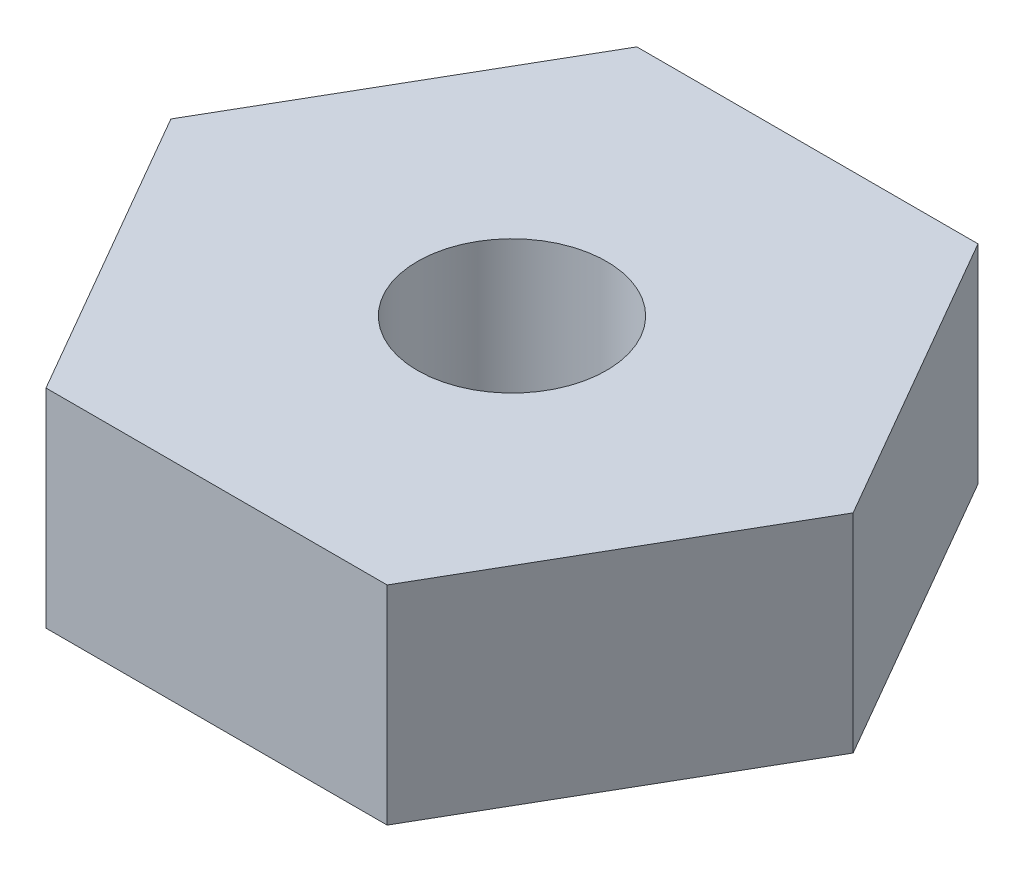
ISO-10303-21;
HEADER;
FILE_DESCRIPTION(('STEP AP214'),'2;1');
FILE_NAME('part.step','',(''),(''),'','','');
FILE_SCHEMA(('AUTOMOTIVE_DESIGN { 1 0 10303 214 1 1 1 1 }'));
ENDSEC;
DATA;
#1=APPLICATION_CONTEXT('core data for automotive mechanical design processes');
#2=APPLICATION_PROTOCOL_DEFINITION('international standard','automotive_design',2000,#1);
#3=PRODUCT_CONTEXT('',#1,'mechanical');
#4=PRODUCT('Part','Part','',(#3));
#5=PRODUCT_RELATED_PRODUCT_CATEGORY('part','',(#4));
#6=PRODUCT_DEFINITION_FORMATION('','',#4);
#7=PRODUCT_DEFINITION_CONTEXT('part definition',#1,'design');
#8=PRODUCT_DEFINITION('design','',#6,#7);
#9=PRODUCT_DEFINITION_SHAPE('','',#8);
#10=(LENGTH_UNIT() NAMED_UNIT(*) SI_UNIT(.MILLI.,.METRE.));
#11=(NAMED_UNIT(*) PLANE_ANGLE_UNIT() SI_UNIT($,.RADIAN.));
#12=(NAMED_UNIT(*) SI_UNIT($,.STERADIAN.) SOLID_ANGLE_UNIT());
#13=UNCERTAINTY_MEASURE_WITH_UNIT(LENGTH_MEASURE(1.E-05),#10,'distance_accuracy_value','');
#14=(GEOMETRIC_REPRESENTATION_CONTEXT(3) GLOBAL_UNCERTAINTY_ASSIGNED_CONTEXT((#13)) GLOBAL_UNIT_ASSIGNED_CONTEXT((#10,
#11,#12)) REPRESENTATION_CONTEXT('',''));
#15=CARTESIAN_POINT('',(0.,0.,0.));
#16=DIRECTION('',(0.,0.,1.));
#17=DIRECTION('',(1.,0.,0.));
#18=AXIS2_PLACEMENT_3D('',#15,#16,#17);
#19=CARTESIAN_POINT('',(0.,1.6764,0.));
#20=DIRECTION('',(0.,-1.,0.));
#21=DIRECTION('',(0.,0.,-1.));
#22=AXIS2_PLACEMENT_3D('',#19,#20,#21);
#23=PLANE('',#22);
#24=DIRECTION('',(-0.5,0.,0.866025403784438));
#25=VECTOR('',#24,1.);
#26=CARTESIAN_POINT('',(-2.74963065701559,1.6764,0.));
#27=LINE('',#26,#25);
#28=CARTESIAN_POINT('',(-1.3748153285078,1.6764,-2.38125));
#29=VERTEX_POINT('',#28);
#30=CARTESIAN_POINT('',(-2.74963065701559,1.6764,0.));
#31=VERTEX_POINT('',#30);
#32=EDGE_CURVE('E130',#29,#31,#27,.T.);
#33=ORIENTED_EDGE('',*,*,#32,.T.);
#34=DIRECTION('',(0.5,0.,0.866025403784438));
#35=VECTOR('',#34,1.);
#36=CARTESIAN_POINT('',(-1.3748153285078,1.6764,2.38125));
#37=LINE('',#36,#35);
#38=CARTESIAN_POINT('',(-1.3748153285078,1.6764,2.38125));
#39=VERTEX_POINT('',#38);
#40=EDGE_CURVE('E88',#31,#39,#37,.T.);
#41=ORIENTED_EDGE('',*,*,#40,.T.);
#42=DIRECTION('',(1.,0.,0.));
#43=VECTOR('',#42,1.);
#44=CARTESIAN_POINT('',(1.3748153285078,1.6764,2.38125));
#45=LINE('',#44,#43);
#46=CARTESIAN_POINT('',(1.3748153285078,1.6764,2.38125));
#47=VERTEX_POINT('',#46);
#48=EDGE_CURVE('E101',#39,#47,#45,.T.);
#49=ORIENTED_EDGE('',*,*,#48,.T.);
#50=DIRECTION('',(0.5,0.,-0.866025403784438));
#51=VECTOR('',#50,1.);
#52=CARTESIAN_POINT('',(2.74963065701559,1.6764,0.));
#53=LINE('',#52,#51);
#54=CARTESIAN_POINT('',(2.74963065701559,1.6764,0.));
#55=VERTEX_POINT('',#54);
#56=EDGE_CURVE('E95',#47,#55,#53,.T.);
#57=ORIENTED_EDGE('',*,*,#56,.T.);
#58=DIRECTION('',(-0.5,0.,-0.866025403784438));
#59=VECTOR('',#58,1.);
#60=CARTESIAN_POINT('',(1.3748153285078,1.6764,-2.38125));
#61=LINE('',#60,#59);
#62=CARTESIAN_POINT('',(1.3748153285078,1.6764,-2.38125));
#63=VERTEX_POINT('',#62);
#64=EDGE_CURVE('E99',#55,#63,#61,.T.);
#65=ORIENTED_EDGE('',*,*,#64,.T.);
#66=DIRECTION('',(-1.,0.,0.));
#67=VECTOR('',#66,1.);
#68=CARTESIAN_POINT('',(-1.3748153285078,1.6764,-2.38125));
#69=LINE('',#68,#67);
#70=EDGE_CURVE('E51',#63,#29,#69,.T.);
#71=ORIENTED_EDGE('',*,*,#70,.T.);
#72=EDGE_LOOP('',(#33,#41,#49,#57,#65,#71));
#73=FACE_BOUND('',#72,.T.);
#74=CARTESIAN_POINT('',(0.,1.6764,0.));
#75=DIRECTION('',(0.,1.,0.));
#76=DIRECTION('',(0.,0.,1.));
#77=AXIS2_PLACEMENT_3D('',#74,#75,#76);
#78=CIRCLE('',#77,0.761999999999999);
#79=CARTESIAN_POINT('',(0.,1.6764,0.761999999999999));
#80=VERTEX_POINT('',#79);
#81=EDGE_CURVE('E123',#80,#80,#78,.T.);
#82=ORIENTED_EDGE('',*,*,#81,.F.);
#83=EDGE_LOOP('',(#82));
#84=FACE_BOUND('',#83,.T.);
#85=ADVANCED_FACE('F34',(#73,#84),#23,.F.);
#86=CARTESIAN_POINT('',(0.,0.,0.));
#87=DIRECTION('',(0.,-1.,0.));
#88=DIRECTION('',(0.,0.,-1.));
#89=AXIS2_PLACEMENT_3D('',#86,#87,#88);
#90=PLANE('',#89);
#91=DIRECTION('',(-0.5,0.,0.866025403784438));
#92=VECTOR('',#91,1.);
#93=CARTESIAN_POINT('',(-2.74963065701559,0.,0.));
#94=LINE('',#93,#92);
#95=CARTESIAN_POINT('',(-1.3748153285078,0.,-2.38125));
#96=VERTEX_POINT('',#95);
#97=CARTESIAN_POINT('',(-2.74963065701559,0.,0.));
#98=VERTEX_POINT('',#97);
#99=EDGE_CURVE('E119',#96,#98,#94,.T.);
#100=ORIENTED_EDGE('',*,*,#99,.F.);
#101=DIRECTION('',(-1.,0.,0.));
#102=VECTOR('',#101,1.);
#103=CARTESIAN_POINT('',(-1.3748153285078,0.,-2.38125));
#104=LINE('',#103,#102);
#105=CARTESIAN_POINT('',(1.3748153285078,0.,-2.38125));
#106=VERTEX_POINT('',#105);
#107=EDGE_CURVE('E80',#106,#96,#104,.T.);
#108=ORIENTED_EDGE('',*,*,#107,.F.);
#109=DIRECTION('',(-0.5,0.,-0.866025403784438));
#110=VECTOR('',#109,1.);
#111=CARTESIAN_POINT('',(1.3748153285078,0.,-2.38125));
#112=LINE('',#111,#110);
#113=CARTESIAN_POINT('',(2.74963065701559,0.,0.));
#114=VERTEX_POINT('',#113);
#115=EDGE_CURVE('E74',#114,#106,#112,.T.);
#116=ORIENTED_EDGE('',*,*,#115,.F.);
#117=DIRECTION('',(0.5,0.,-0.866025403784438));
#118=VECTOR('',#117,1.);
#119=CARTESIAN_POINT('',(2.74963065701559,0.,0.));
#120=LINE('',#119,#118);
#121=CARTESIAN_POINT('',(1.3748153285078,0.,2.38125));
#122=VERTEX_POINT('',#121);
#123=EDGE_CURVE('E109',#122,#114,#120,.T.);
#124=ORIENTED_EDGE('',*,*,#123,.F.);
#125=DIRECTION('',(1.,0.,0.));
#126=VECTOR('',#125,1.);
#127=CARTESIAN_POINT('',(1.3748153285078,0.,2.38125));
#128=LINE('',#127,#126);
#129=CARTESIAN_POINT('',(-1.3748153285078,0.,2.38125));
#130=VERTEX_POINT('',#129);
#131=EDGE_CURVE('E125',#130,#122,#128,.T.);
#132=ORIENTED_EDGE('',*,*,#131,.F.);
#133=DIRECTION('',(0.5,0.,0.866025403784438));
#134=VECTOR('',#133,1.);
#135=CARTESIAN_POINT('',(-1.3748153285078,0.,2.38125));
#136=LINE('',#135,#134);
#137=EDGE_CURVE('E122',#98,#130,#136,.T.);
#138=ORIENTED_EDGE('',*,*,#137,.F.);
#139=EDGE_LOOP('',(#100,#108,#116,#124,#132,#138));
#140=FACE_BOUND('',#139,.T.);
#141=CARTESIAN_POINT('',(0.,0.,0.));
#142=DIRECTION('',(0.,1.,0.));
#143=DIRECTION('',(0.,0.,1.));
#144=AXIS2_PLACEMENT_3D('',#141,#142,#143);
#145=CIRCLE('',#144,0.761999999999999);
#146=CARTESIAN_POINT('',(0.,0.,0.761999999999999));
#147=VERTEX_POINT('',#146);
#148=EDGE_CURVE('E223',#147,#147,#145,.T.);
#149=ORIENTED_EDGE('',*,*,#148,.T.);
#150=EDGE_LOOP('',(#149));
#151=FACE_BOUND('',#150,.T.);
#152=ADVANCED_FACE('F139',(#140,#151),#90,.T.);
#153=CARTESIAN_POINT('',(-2.74963065701559,1.6764,0.));
#154=DIRECTION('',(0.866025403784438,0.,0.5));
#155=DIRECTION('',(0.5,0.,-0.866025403784439));
#156=AXIS2_PLACEMENT_3D('',#153,#154,#155);
#157=PLANE('',#156);
#158=ORIENTED_EDGE('',*,*,#99,.T.);
#159=DIRECTION('',(0.,-1.,0.));
#160=VECTOR('',#159,1.);
#161=CARTESIAN_POINT('',(-2.74963065701559,1.6764,0.));
#162=LINE('',#161,#160);
#163=EDGE_CURVE('E11',#31,#98,#162,.T.);
#164=ORIENTED_EDGE('',*,*,#163,.F.);
#165=ORIENTED_EDGE('',*,*,#32,.F.);
#166=DIRECTION('',(0.,-1.,0.));
#167=VECTOR('',#166,1.);
#168=CARTESIAN_POINT('',(-1.3748153285078,1.6764,-2.38125));
#169=LINE('',#168,#167);
#170=EDGE_CURVE('E115',#29,#96,#169,.T.);
#171=ORIENTED_EDGE('',*,*,#170,.T.);
#172=EDGE_LOOP('',(#158,#164,#165,#171));
#173=FACE_BOUND('',#172,.T.);
#174=ADVANCED_FACE('F36',(#173),#157,.F.);
#175=CARTESIAN_POINT('',(-1.3748153285078,1.6764,2.38125));
#176=DIRECTION('',(0.866025403784438,0.,-0.5));
#177=DIRECTION('',(-0.5,0.,-0.866025403784439));
#178=AXIS2_PLACEMENT_3D('',#175,#176,#177);
#179=PLANE('',#178);
#180=ORIENTED_EDGE('',*,*,#137,.T.);
#181=DIRECTION('',(0.,-1.,0.));
#182=VECTOR('',#181,1.);
#183=CARTESIAN_POINT('',(-1.3748153285078,1.6764,2.38125));
#184=LINE('',#183,#182);
#185=EDGE_CURVE('E43',#39,#130,#184,.T.);
#186=ORIENTED_EDGE('',*,*,#185,.F.);
#187=ORIENTED_EDGE('',*,*,#40,.F.);
#188=ORIENTED_EDGE('',*,*,#163,.T.);
#189=EDGE_LOOP('',(#180,#186,#187,#188));
#190=FACE_BOUND('',#189,.T.);
#191=ADVANCED_FACE('F164',(#190),#179,.F.);
#192=CARTESIAN_POINT('',(1.3748153285078,1.6764,2.38125));
#193=DIRECTION('',(0.,0.,-1.));
#194=DIRECTION('',(-1.,0.,0.));
#195=AXIS2_PLACEMENT_3D('',#192,#193,#194);
#196=PLANE('',#195);
#197=ORIENTED_EDGE('',*,*,#131,.T.);
#198=DIRECTION('',(0.,-1.,0.));
#199=VECTOR('',#198,1.);
#200=CARTESIAN_POINT('',(1.3748153285078,1.6764,2.38125));
#201=LINE('',#200,#199);
#202=EDGE_CURVE('E110',#47,#122,#201,.T.);
#203=ORIENTED_EDGE('',*,*,#202,.F.);
#204=ORIENTED_EDGE('',*,*,#48,.F.);
#205=ORIENTED_EDGE('',*,*,#185,.T.);
#206=EDGE_LOOP('',(#197,#203,#204,#205));
#207=FACE_BOUND('',#206,.T.);
#208=ADVANCED_FACE('F136',(#207),#196,.F.);
#209=CARTESIAN_POINT('',(2.74963065701559,1.6764,0.));
#210=DIRECTION('',(-0.866025403784438,0.,-0.5));
#211=DIRECTION('',(-0.5,0.,0.866025403784439));
#212=AXIS2_PLACEMENT_3D('',#209,#210,#211);
#213=PLANE('',#212);
#214=ORIENTED_EDGE('',*,*,#123,.T.);
#215=DIRECTION('',(0.,-1.,0.));
#216=VECTOR('',#215,1.);
#217=CARTESIAN_POINT('',(2.74963065701559,1.6764,0.));
#218=LINE('',#217,#216);
#219=EDGE_CURVE('E106',#55,#114,#218,.T.);
#220=ORIENTED_EDGE('',*,*,#219,.F.);
#221=ORIENTED_EDGE('',*,*,#56,.F.);
#222=ORIENTED_EDGE('',*,*,#202,.T.);
#223=EDGE_LOOP('',(#214,#220,#221,#222));
#224=FACE_BOUND('',#223,.T.);
#225=ADVANCED_FACE('F107',(#224),#213,.F.);
#226=CARTESIAN_POINT('',(1.3748153285078,1.6764,-2.38125));
#227=DIRECTION('',(-0.866025403784438,0.,0.5));
#228=DIRECTION('',(0.5,0.,0.866025403784439));
#229=AXIS2_PLACEMENT_3D('',#226,#227,#228);
#230=PLANE('',#229);
#231=ORIENTED_EDGE('',*,*,#115,.T.);
#232=DIRECTION('',(0.,-1.,0.));
#233=VECTOR('',#232,1.);
#234=CARTESIAN_POINT('',(1.3748153285078,1.6764,-2.38125));
#235=LINE('',#234,#233);
#236=EDGE_CURVE('E111',#63,#106,#235,.T.);
#237=ORIENTED_EDGE('',*,*,#236,.F.);
#238=ORIENTED_EDGE('',*,*,#64,.F.);
#239=ORIENTED_EDGE('',*,*,#219,.T.);
#240=EDGE_LOOP('',(#231,#237,#238,#239));
#241=FACE_BOUND('',#240,.T.);
#242=ADVANCED_FACE('F113',(#241),#230,.F.);
#243=CARTESIAN_POINT('',(-1.3748153285078,1.6764,-2.38125));
#244=DIRECTION('',(0.,0.,1.));
#245=DIRECTION('',(1.,0.,0.));
#246=AXIS2_PLACEMENT_3D('',#243,#244,#245);
#247=PLANE('',#246);
#248=ORIENTED_EDGE('',*,*,#107,.T.);
#249=ORIENTED_EDGE('',*,*,#170,.F.);
#250=ORIENTED_EDGE('',*,*,#70,.F.);
#251=ORIENTED_EDGE('',*,*,#236,.T.);
#252=EDGE_LOOP('',(#248,#249,#250,#251));
#253=FACE_BOUND('',#252,.T.);
#254=ADVANCED_FACE('F144',(#253),#247,.F.);
#255=CARTESIAN_POINT('',(0.,1.6764,0.));
#256=DIRECTION('',(0.,-1.,0.));
#257=DIRECTION('',(0.,0.,-1.));
#258=AXIS2_PLACEMENT_3D('',#255,#256,#257);
#259=CYLINDRICAL_SURFACE('',#258,0.761999999999999);
#260=ORIENTED_EDGE('',*,*,#81,.T.);
#261=EDGE_LOOP('',(#260));
#262=FACE_BOUND('',#261,.T.);
#263=ORIENTED_EDGE('',*,*,#148,.F.);
#264=EDGE_LOOP('',(#263));
#265=FACE_BOUND('',#264,.T.);
#266=ADVANCED_FACE('F146',(#262,#265),#259,.F.);
#267=CLOSED_SHELL('',(#85,#152,#174,#191,#208,#225,#242,#254,#266));
#268=MANIFOLD_SOLID_BREP('B2',#267);
#269=ADVANCED_BREP_SHAPE_REPRESENTATION('',(#18,#268),#14);
#270=SHAPE_DEFINITION_REPRESENTATION(#9,#269);
ENDSEC;
END-ISO-10303-21;
